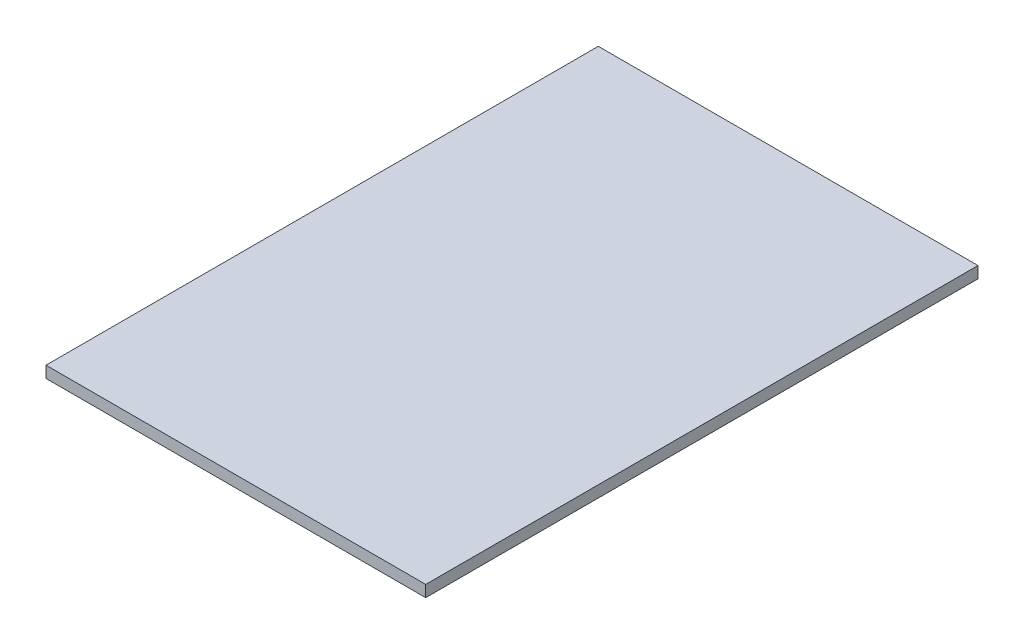
ISO-10303-21;
HEADER;
FILE_DESCRIPTION(('STEP AP214'),'2;1');
FILE_NAME('part.step','',(''),(''),'','','');
FILE_SCHEMA(('AUTOMOTIVE_DESIGN { 1 0 10303 214 1 1 1 1 }'));
ENDSEC;
DATA;
#1=APPLICATION_CONTEXT('core data for automotive mechanical design processes');
#2=APPLICATION_PROTOCOL_DEFINITION('international standard','automotive_design',2000,#1);
#3=PRODUCT_CONTEXT('',#1,'mechanical');
#4=PRODUCT('Part','Part','',(#3));
#5=PRODUCT_RELATED_PRODUCT_CATEGORY('part','',(#4));
#6=PRODUCT_DEFINITION_FORMATION('','',#4);
#7=PRODUCT_DEFINITION_CONTEXT('part definition',#1,'design');
#8=PRODUCT_DEFINITION('design','',#6,#7);
#9=PRODUCT_DEFINITION_SHAPE('','',#8);
#10=(LENGTH_UNIT() NAMED_UNIT(*) SI_UNIT(.MILLI.,.METRE.));
#11=(NAMED_UNIT(*) PLANE_ANGLE_UNIT() SI_UNIT($,.RADIAN.));
#12=(NAMED_UNIT(*) SI_UNIT($,.STERADIAN.) SOLID_ANGLE_UNIT());
#13=UNCERTAINTY_MEASURE_WITH_UNIT(LENGTH_MEASURE(1.E-05),#10,'distance_accuracy_value','');
#14=(GEOMETRIC_REPRESENTATION_CONTEXT(3) GLOBAL_UNCERTAINTY_ASSIGNED_CONTEXT((#13)) GLOBAL_UNIT_ASSIGNED_CONTEXT((#10,
#11,#12)) REPRESENTATION_CONTEXT('',''));
#15=CARTESIAN_POINT('',(0.,0.,0.));
#16=DIRECTION('',(0.,0.,1.));
#17=DIRECTION('',(1.,0.,0.));
#18=AXIS2_PLACEMENT_3D('',#15,#16,#17);
#19=CARTESIAN_POINT('',(-33.,2.,-48.));
#20=DIRECTION('',(0.,0.,-1.));
#21=DIRECTION('',(-1.,0.,0.));
#22=AXIS2_PLACEMENT_3D('',#19,#20,#21);
#23=PLANE('',#22);
#24=DIRECTION('',(1.,0.,0.));
#25=VECTOR('',#24,1.);
#26=CARTESIAN_POINT('',(-33.,0.,-48.));
#27=LINE('',#26,#25);
#28=CARTESIAN_POINT('',(-33.,0.,-48.));
#29=VERTEX_POINT('',#28);
#30=CARTESIAN_POINT('',(33.,0.,-48.));
#31=VERTEX_POINT('',#30);
#32=EDGE_CURVE('E103',#29,#31,#27,.T.);
#33=ORIENTED_EDGE('',*,*,#32,.F.);
#34=DIRECTION('',(0.,-1.,0.));
#35=VECTOR('',#34,1.);
#36=CARTESIAN_POINT('',(-33.,2.,-48.));
#37=LINE('',#36,#35);
#38=CARTESIAN_POINT('',(-33.,2.,-48.));
#39=VERTEX_POINT('',#38);
#40=EDGE_CURVE('E11',#39,#29,#37,.T.);
#41=ORIENTED_EDGE('',*,*,#40,.F.);
#42=DIRECTION('',(1.,0.,0.));
#43=VECTOR('',#42,1.);
#44=CARTESIAN_POINT('',(-33.,2.,-48.));
#45=LINE('',#44,#43);
#46=CARTESIAN_POINT('',(33.,2.,-48.));
#47=VERTEX_POINT('',#46);
#48=EDGE_CURVE('E98',#39,#47,#45,.T.);
#49=ORIENTED_EDGE('',*,*,#48,.T.);
#50=DIRECTION('',(0.,-1.,0.));
#51=VECTOR('',#50,1.);
#52=CARTESIAN_POINT('',(33.,2.,-48.));
#53=LINE('',#52,#51);
#54=EDGE_CURVE('E41',#47,#31,#53,.T.);
#55=ORIENTED_EDGE('',*,*,#54,.T.);
#56=EDGE_LOOP('',(#33,#41,#49,#55));
#57=FACE_BOUND('',#56,.T.);
#58=ADVANCED_FACE('F38',(#57),#23,.T.);
#59=CARTESIAN_POINT('',(-33.,2.,-48.));
#60=DIRECTION('',(1.,0.,0.));
#61=DIRECTION('',(0.,0.,-1.));
#62=AXIS2_PLACEMENT_3D('',#59,#60,#61);
#63=PLANE('',#62);
#64=DIRECTION('',(0.,0.,1.));
#65=VECTOR('',#64,1.);
#66=CARTESIAN_POINT('',(-33.,0.,-48.));
#67=LINE('',#66,#65);
#68=CARTESIAN_POINT('',(-33.,0.,48.));
#69=VERTEX_POINT('',#68);
#70=EDGE_CURVE('E71',#29,#69,#67,.T.);
#71=ORIENTED_EDGE('',*,*,#70,.T.);
#72=DIRECTION('',(0.,-1.,0.));
#73=VECTOR('',#72,1.);
#74=CARTESIAN_POINT('',(-33.,2.,48.));
#75=LINE('',#74,#73);
#76=CARTESIAN_POINT('',(-33.,2.,48.));
#77=VERTEX_POINT('',#76);
#78=EDGE_CURVE('E47',#77,#69,#75,.T.);
#79=ORIENTED_EDGE('',*,*,#78,.F.);
#80=DIRECTION('',(0.,0.,1.));
#81=VECTOR('',#80,1.);
#82=CARTESIAN_POINT('',(-33.,2.,-48.));
#83=LINE('',#82,#81);
#84=EDGE_CURVE('E88',#39,#77,#83,.T.);
#85=ORIENTED_EDGE('',*,*,#84,.F.);
#86=ORIENTED_EDGE('',*,*,#40,.T.);
#87=EDGE_LOOP('',(#71,#79,#85,#86));
#88=FACE_BOUND('',#87,.T.);
#89=ADVANCED_FACE('F113',(#88),#63,.F.);
#90=CARTESIAN_POINT('',(-33.,2.,48.));
#91=DIRECTION('',(0.,0.,-1.));
#92=DIRECTION('',(-1.,0.,0.));
#93=AXIS2_PLACEMENT_3D('',#90,#91,#92);
#94=PLANE('',#93);
#95=DIRECTION('',(1.,0.,0.));
#96=VECTOR('',#95,1.);
#97=CARTESIAN_POINT('',(-33.,0.,48.));
#98=LINE('',#97,#96);
#99=CARTESIAN_POINT('',(33.,0.,48.));
#100=VERTEX_POINT('',#99);
#101=EDGE_CURVE('E95',#69,#100,#98,.T.);
#102=ORIENTED_EDGE('',*,*,#101,.T.);
#103=DIRECTION('',(0.,-1.,0.));
#104=VECTOR('',#103,1.);
#105=CARTESIAN_POINT('',(33.,2.,48.));
#106=LINE('',#105,#104);
#107=CARTESIAN_POINT('',(33.,2.,48.));
#108=VERTEX_POINT('',#107);
#109=EDGE_CURVE('E92',#108,#100,#106,.T.);
#110=ORIENTED_EDGE('',*,*,#109,.F.);
#111=DIRECTION('',(1.,0.,0.));
#112=VECTOR('',#111,1.);
#113=CARTESIAN_POINT('',(-33.,2.,48.));
#114=LINE('',#113,#112);
#115=EDGE_CURVE('E83',#77,#108,#114,.T.);
#116=ORIENTED_EDGE('',*,*,#115,.F.);
#117=ORIENTED_EDGE('',*,*,#78,.T.);
#118=EDGE_LOOP('',(#102,#110,#116,#117));
#119=FACE_BOUND('',#118,.T.);
#120=ADVANCED_FACE('F93',(#119),#94,.F.);
#121=CARTESIAN_POINT('',(33.,2.,-48.));
#122=DIRECTION('',(1.,0.,0.));
#123=DIRECTION('',(0.,0.,-1.));
#124=AXIS2_PLACEMENT_3D('',#121,#122,#123);
#125=PLANE('',#124);
#126=DIRECTION('',(0.,0.,1.));
#127=VECTOR('',#126,1.);
#128=CARTESIAN_POINT('',(33.,0.,-48.));
#129=LINE('',#128,#127);
#130=EDGE_CURVE('E106',#31,#100,#129,.T.);
#131=ORIENTED_EDGE('',*,*,#130,.F.);
#132=ORIENTED_EDGE('',*,*,#54,.F.);
#133=DIRECTION('',(0.,0.,1.));
#134=VECTOR('',#133,1.);
#135=CARTESIAN_POINT('',(33.,2.,-48.));
#136=LINE('',#135,#134);
#137=EDGE_CURVE('E87',#47,#108,#136,.T.);
#138=ORIENTED_EDGE('',*,*,#137,.T.);
#139=ORIENTED_EDGE('',*,*,#109,.T.);
#140=EDGE_LOOP('',(#131,#132,#138,#139));
#141=FACE_BOUND('',#140,.T.);
#142=ADVANCED_FACE('F97',(#141),#125,.T.);
#143=CARTESIAN_POINT('',(0.,2.,0.));
#144=DIRECTION('',(0.,-1.,0.));
#145=DIRECTION('',(0.,0.,-1.));
#146=AXIS2_PLACEMENT_3D('',#143,#144,#145);
#147=PLANE('',#146);
#148=ORIENTED_EDGE('',*,*,#48,.F.);
#149=ORIENTED_EDGE('',*,*,#84,.T.);
#150=ORIENTED_EDGE('',*,*,#115,.T.);
#151=ORIENTED_EDGE('',*,*,#137,.F.);
#152=EDGE_LOOP('',(#148,#149,#150,#151));
#153=FACE_BOUND('',#152,.T.);
#154=ADVANCED_FACE('F86',(#153),#147,.F.);
#155=CARTESIAN_POINT('',(0.,0.,0.));
#156=DIRECTION('',(0.,-1.,0.));
#157=DIRECTION('',(0.,0.,-1.));
#158=AXIS2_PLACEMENT_3D('',#155,#156,#157);
#159=PLANE('',#158);
#160=ORIENTED_EDGE('',*,*,#32,.T.);
#161=ORIENTED_EDGE('',*,*,#130,.T.);
#162=ORIENTED_EDGE('',*,*,#101,.F.);
#163=ORIENTED_EDGE('',*,*,#70,.F.);
#164=EDGE_LOOP('',(#160,#161,#162,#163));
#165=FACE_BOUND('',#164,.T.);
#166=ADVANCED_FACE('F111',(#165),#159,.T.);
#167=CLOSED_SHELL('',(#58,#89,#120,#142,#154,#166));
#168=MANIFOLD_SOLID_BREP('B2',#167);
#169=ADVANCED_BREP_SHAPE_REPRESENTATION('',(#18,#168),#14);
#170=SHAPE_DEFINITION_REPRESENTATION(#9,#169);
ENDSEC;
END-ISO-10303-21;
